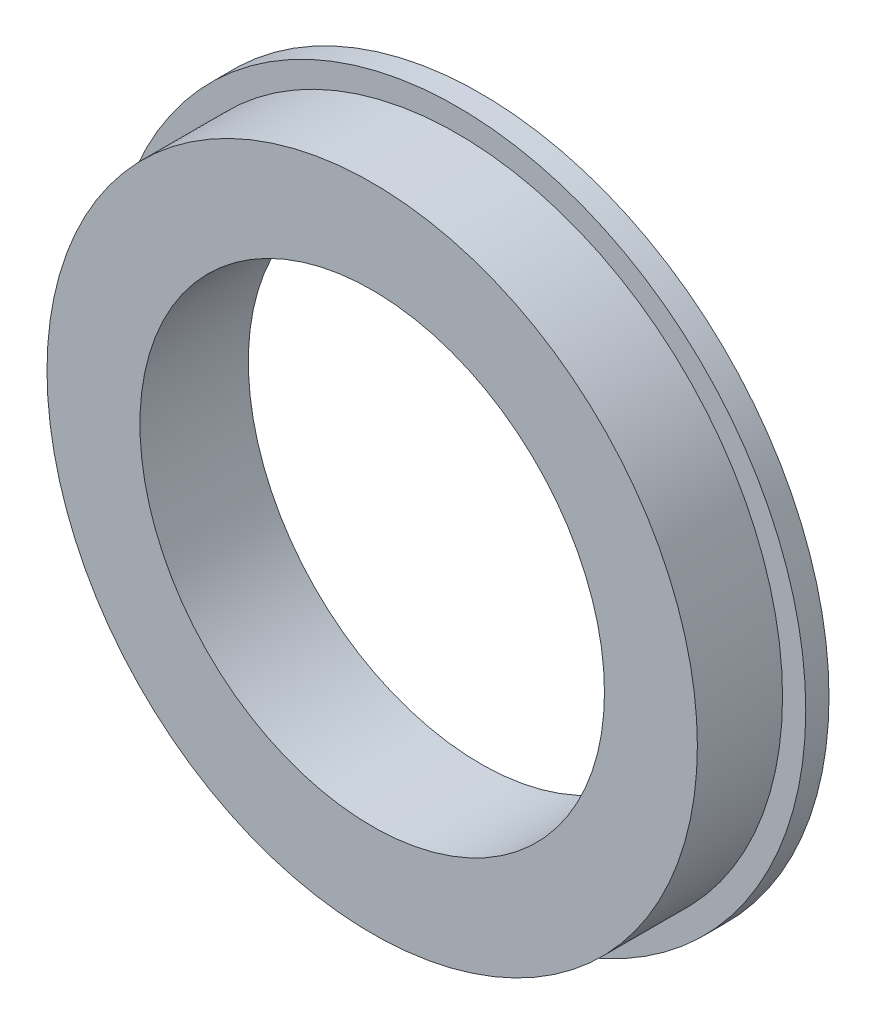
ISO-10303-21;
HEADER;
FILE_DESCRIPTION(('STEP AP214'),'2;1');
FILE_NAME('part.step','',(''),(''),'','','');
FILE_SCHEMA(('AUTOMOTIVE_DESIGN { 1 0 10303 214 1 1 1 1 }'));
ENDSEC;
DATA;
#1=APPLICATION_CONTEXT('core data for automotive mechanical design processes');
#2=APPLICATION_PROTOCOL_DEFINITION('international standard','automotive_design',2000,#1);
#3=PRODUCT_CONTEXT('',#1,'mechanical');
#4=PRODUCT('Part','Part','',(#3));
#5=PRODUCT_RELATED_PRODUCT_CATEGORY('part','',(#4));
#6=PRODUCT_DEFINITION_FORMATION('','',#4);
#7=PRODUCT_DEFINITION_CONTEXT('part definition',#1,'design');
#8=PRODUCT_DEFINITION('design','',#6,#7);
#9=PRODUCT_DEFINITION_SHAPE('','',#8);
#10=(LENGTH_UNIT() NAMED_UNIT(*) SI_UNIT(.MILLI.,.METRE.));
#11=(NAMED_UNIT(*) PLANE_ANGLE_UNIT() SI_UNIT($,.RADIAN.));
#12=(NAMED_UNIT(*) SI_UNIT($,.STERADIAN.) SOLID_ANGLE_UNIT());
#13=UNCERTAINTY_MEASURE_WITH_UNIT(LENGTH_MEASURE(1.E-05),#10,'distance_accuracy_value','');
#14=(GEOMETRIC_REPRESENTATION_CONTEXT(3) GLOBAL_UNCERTAINTY_ASSIGNED_CONTEXT((#13)) GLOBAL_UNIT_ASSIGNED_CONTEXT((#10,
#11,#12)) REPRESENTATION_CONTEXT('',''));
#15=CARTESIAN_POINT('',(0.,0.,0.));
#16=DIRECTION('',(0.,0.,1.));
#17=DIRECTION('',(1.,0.,0.));
#18=AXIS2_PLACEMENT_3D('',#15,#16,#17);
#19=CARTESIAN_POINT('',(0.,0.,7.));
#20=DIRECTION('',(0.,0.,1.));
#21=DIRECTION('',(1.,0.,0.));
#22=AXIS2_PLACEMENT_3D('',#19,#20,#21);
#23=PLANE('',#22);
#24=CARTESIAN_POINT('',(0.,0.,7.));
#25=DIRECTION('',(0.,0.,1.));
#26=DIRECTION('',(1.,0.,0.));
#27=AXIS2_PLACEMENT_3D('',#24,#25,#26);
#28=CIRCLE('',#27,21.);
#29=CARTESIAN_POINT('',(21.,0.,7.));
#30=VERTEX_POINT('',#29);
#31=EDGE_CURVE('E10',#30,#30,#28,.T.);
#32=ORIENTED_EDGE('',*,*,#31,.T.);
#33=EDGE_LOOP('',(#32));
#34=FACE_BOUND('',#33,.T.);
#35=CARTESIAN_POINT('',(0.,0.,7.));
#36=DIRECTION('',(0.,0.,1.));
#37=DIRECTION('',(1.,0.,0.));
#38=AXIS2_PLACEMENT_3D('',#35,#36,#37);
#39=CIRCLE('',#38,15.);
#40=CARTESIAN_POINT('',(15.,0.,7.));
#41=VERTEX_POINT('',#40);
#42=EDGE_CURVE('E40',#41,#41,#39,.T.);
#43=ORIENTED_EDGE('',*,*,#42,.F.);
#44=EDGE_LOOP('',(#43));
#45=FACE_BOUND('',#44,.T.);
#46=ADVANCED_FACE('F33',(#34,#45),#23,.T.);
#47=CARTESIAN_POINT('',(0.,0.,0.));
#48=DIRECTION('',(0.,0.,1.));
#49=DIRECTION('',(1.,0.,0.));
#50=AXIS2_PLACEMENT_3D('',#47,#48,#49);
#51=PLANE('',#50);
#52=CARTESIAN_POINT('',(0.,0.,0.));
#53=DIRECTION('',(0.,0.,1.));
#54=DIRECTION('',(1.,0.,0.));
#55=AXIS2_PLACEMENT_3D('',#52,#53,#54);
#56=CIRCLE('',#55,15.);
#57=CARTESIAN_POINT('',(15.,0.,0.));
#58=VERTEX_POINT('',#57);
#59=EDGE_CURVE('E44',#58,#58,#56,.T.);
#60=ORIENTED_EDGE('',*,*,#59,.T.);
#61=EDGE_LOOP('',(#60));
#62=FACE_BOUND('',#61,.T.);
#63=CARTESIAN_POINT('',(0.,0.,0.));
#64=DIRECTION('',(0.,0.,1.));
#65=DIRECTION('',(1.,0.,0.));
#66=AXIS2_PLACEMENT_3D('',#63,#64,#65);
#67=CIRCLE('',#66,22.5);
#68=CARTESIAN_POINT('',(22.5,0.,0.));
#69=VERTEX_POINT('',#68);
#70=EDGE_CURVE('E51',#69,#69,#67,.T.);
#71=ORIENTED_EDGE('',*,*,#70,.F.);
#72=EDGE_LOOP('',(#71));
#73=FACE_BOUND('',#72,.T.);
#74=ADVANCED_FACE('F76',(#62,#73),#51,.F.);
#75=CARTESIAN_POINT('',(0.,0.,7.));
#76=DIRECTION('',(0.,0.,-1.));
#77=DIRECTION('',(-1.,0.,0.));
#78=AXIS2_PLACEMENT_3D('',#75,#76,#77);
#79=CYLINDRICAL_SURFACE('',#78,21.);
#80=CARTESIAN_POINT('',(0.,0.,1.5));
#81=DIRECTION('',(0.,0.,1.));
#82=DIRECTION('',(1.,0.,0.));
#83=AXIS2_PLACEMENT_3D('',#80,#81,#82);
#84=CIRCLE('',#83,21.);
#85=CARTESIAN_POINT('',(21.,0.,1.5));
#86=VERTEX_POINT('',#85);
#87=EDGE_CURVE('E54',#86,#86,#84,.T.);
#88=ORIENTED_EDGE('',*,*,#87,.T.);
#89=EDGE_LOOP('',(#88));
#90=FACE_BOUND('',#89,.T.);
#91=ORIENTED_EDGE('',*,*,#31,.F.);
#92=EDGE_LOOP('',(#91));
#93=FACE_BOUND('',#92,.T.);
#94=ADVANCED_FACE('F35',(#90,#93),#79,.T.);
#95=CARTESIAN_POINT('',(0.,0.,7.));
#96=DIRECTION('',(0.,0.,-1.));
#97=DIRECTION('',(-1.,0.,0.));
#98=AXIS2_PLACEMENT_3D('',#95,#96,#97);
#99=CYLINDRICAL_SURFACE('',#98,15.);
#100=ORIENTED_EDGE('',*,*,#42,.T.);
#101=EDGE_LOOP('',(#100));
#102=FACE_BOUND('',#101,.T.);
#103=ORIENTED_EDGE('',*,*,#59,.F.);
#104=EDGE_LOOP('',(#103));
#105=FACE_BOUND('',#104,.T.);
#106=ADVANCED_FACE('F65',(#102,#105),#99,.F.);
#107=CARTESIAN_POINT('',(0.,0.,1.5));
#108=DIRECTION('',(0.,0.,1.));
#109=DIRECTION('',(1.,0.,0.));
#110=AXIS2_PLACEMENT_3D('',#107,#108,#109);
#111=PLANE('',#110);
#112=CARTESIAN_POINT('',(0.,0.,1.5));
#113=DIRECTION('',(0.,0.,1.));
#114=DIRECTION('',(1.,0.,0.));
#115=AXIS2_PLACEMENT_3D('',#112,#113,#114);
#116=CIRCLE('',#115,22.5);
#117=CARTESIAN_POINT('',(22.5,0.,1.5));
#118=VERTEX_POINT('',#117);
#119=EDGE_CURVE('E49',#118,#118,#116,.T.);
#120=ORIENTED_EDGE('',*,*,#119,.T.);
#121=EDGE_LOOP('',(#120));
#122=FACE_BOUND('',#121,.T.);
#123=ORIENTED_EDGE('',*,*,#87,.F.);
#124=EDGE_LOOP('',(#123));
#125=FACE_BOUND('',#124,.T.);
#126=ADVANCED_FACE('F62',(#122,#125),#111,.T.);
#127=CARTESIAN_POINT('',(0.,0.,1.5));
#128=DIRECTION('',(0.,0.,-1.));
#129=DIRECTION('',(-1.,0.,0.));
#130=AXIS2_PLACEMENT_3D('',#127,#128,#129);
#131=CYLINDRICAL_SURFACE('',#130,22.5);
#132=ORIENTED_EDGE('',*,*,#119,.F.);
#133=EDGE_LOOP('',(#132));
#134=FACE_BOUND('',#133,.T.);
#135=ORIENTED_EDGE('',*,*,#70,.T.);
#136=EDGE_LOOP('',(#135));
#137=FACE_BOUND('',#136,.T.);
#138=ADVANCED_FACE('F64',(#134,#137),#131,.T.);
#139=CLOSED_SHELL('',(#46,#74,#94,#106,#126,#138));
#140=MANIFOLD_SOLID_BREP('B2',#139);
#141=ADVANCED_BREP_SHAPE_REPRESENTATION('',(#18,#140),#14);
#142=SHAPE_DEFINITION_REPRESENTATION(#9,#141);
ENDSEC;
END-ISO-10303-21;
